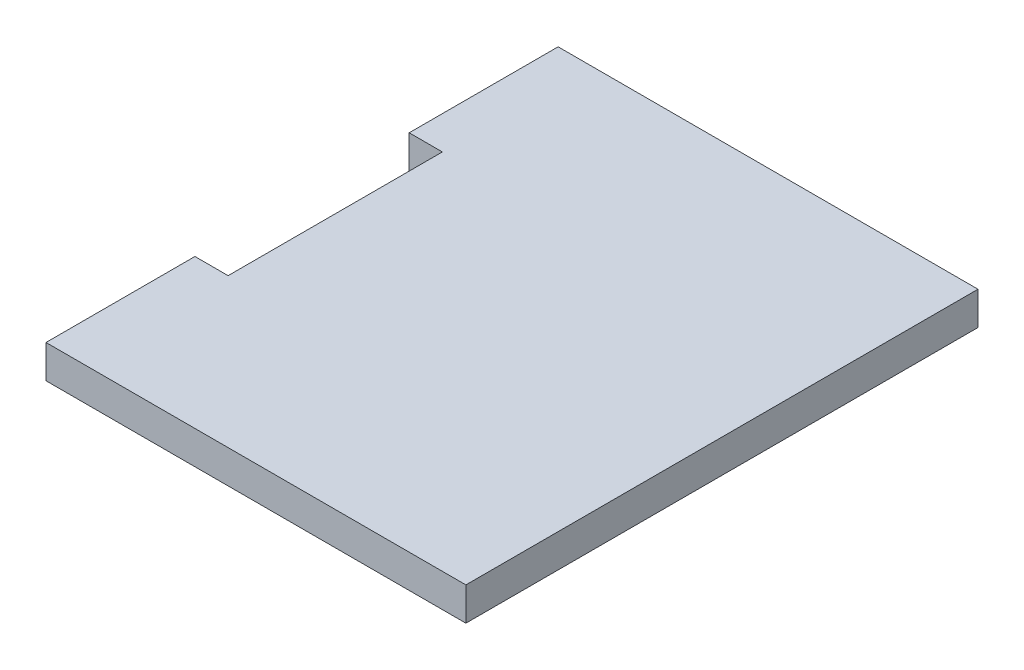
ISO-10303-21;
HEADER;
FILE_DESCRIPTION(('STEP AP214'),'2;1');
FILE_NAME('part.step','',(''),(''),'','','');
FILE_SCHEMA(('AUTOMOTIVE_DESIGN { 1 0 10303 214 1 1 1 1 }'));
ENDSEC;
DATA;
#1=APPLICATION_CONTEXT('core data for automotive mechanical design processes');
#2=APPLICATION_PROTOCOL_DEFINITION('international standard','automotive_design',2000,#1);
#3=PRODUCT_CONTEXT('',#1,'mechanical');
#4=PRODUCT('Part','Part','',(#3));
#5=PRODUCT_RELATED_PRODUCT_CATEGORY('part','',(#4));
#6=PRODUCT_DEFINITION_FORMATION('','',#4);
#7=PRODUCT_DEFINITION_CONTEXT('part definition',#1,'design');
#8=PRODUCT_DEFINITION('design','',#6,#7);
#9=PRODUCT_DEFINITION_SHAPE('','',#8);
#10=(LENGTH_UNIT() NAMED_UNIT(*) SI_UNIT(.MILLI.,.METRE.));
#11=(NAMED_UNIT(*) PLANE_ANGLE_UNIT() SI_UNIT($,.RADIAN.));
#12=(NAMED_UNIT(*) SI_UNIT($,.STERADIAN.) SOLID_ANGLE_UNIT());
#13=UNCERTAINTY_MEASURE_WITH_UNIT(LENGTH_MEASURE(1.E-05),#10,'distance_accuracy_value','');
#14=(GEOMETRIC_REPRESENTATION_CONTEXT(3) GLOBAL_UNCERTAINTY_ASSIGNED_CONTEXT((#13)) GLOBAL_UNIT_ASSIGNED_CONTEXT((#10,
#11,#12)) REPRESENTATION_CONTEXT('',''));
#15=CARTESIAN_POINT('',(0.,0.,0.));
#16=DIRECTION('',(0.,0.,1.));
#17=DIRECTION('',(1.,0.,0.));
#18=AXIS2_PLACEMENT_3D('',#15,#16,#17);
#19=CARTESIAN_POINT('',(-37.,3.175,0.));
#20=DIRECTION('',(-1.,0.,0.));
#21=DIRECTION('',(0.,0.,1.));
#22=AXIS2_PLACEMENT_3D('',#19,#20,#21);
#23=PLANE('',#22);
#24=DIRECTION('',(0.,0.,-1.));
#25=VECTOR('',#24,1.);
#26=CARTESIAN_POINT('',(-37.,0.,0.));
#27=LINE('',#26,#25);
#28=CARTESIAN_POINT('',(-37.,0.,-14.25));
#29=VERTEX_POINT('',#28);
#30=CARTESIAN_POINT('',(-37.,0.,-34.75));
#31=VERTEX_POINT('',#30);
#32=EDGE_CURVE('E162',#29,#31,#27,.T.);
#33=ORIENTED_EDGE('',*,*,#32,.F.);
#34=DIRECTION('',(0.,-1.,0.));
#35=VECTOR('',#34,1.);
#36=CARTESIAN_POINT('',(-37.,3.175,-14.25));
#37=LINE('',#36,#35);
#38=CARTESIAN_POINT('',(-37.,3.175,-14.25));
#39=VERTEX_POINT('',#38);
#40=EDGE_CURVE('E11',#39,#29,#37,.T.);
#41=ORIENTED_EDGE('',*,*,#40,.F.);
#42=DIRECTION('',(0.,0.,-1.));
#43=VECTOR('',#42,1.);
#44=CARTESIAN_POINT('',(-37.,3.175,0.));
#45=LINE('',#44,#43);
#46=CARTESIAN_POINT('',(-37.,3.175,-34.75));
#47=VERTEX_POINT('',#46);
#48=EDGE_CURVE('E134',#39,#47,#45,.T.);
#49=ORIENTED_EDGE('',*,*,#48,.T.);
#50=DIRECTION('',(0.,-1.,0.));
#51=VECTOR('',#50,1.);
#52=CARTESIAN_POINT('',(-37.,3.175,-34.75));
#53=LINE('',#52,#51);
#54=EDGE_CURVE('E82',#47,#31,#53,.T.);
#55=ORIENTED_EDGE('',*,*,#54,.T.);
#56=EDGE_LOOP('',(#33,#41,#49,#55));
#57=FACE_BOUND('',#56,.T.);
#58=ADVANCED_FACE('F32',(#57),#23,.T.);
#59=CARTESIAN_POINT('',(0.,3.175,-14.25));
#60=DIRECTION('',(0.,0.,-1.));
#61=DIRECTION('',(-1.,0.,0.));
#62=AXIS2_PLACEMENT_3D('',#59,#60,#61);
#63=PLANE('',#62);
#64=DIRECTION('',(1.,0.,0.));
#65=VECTOR('',#64,1.);
#66=CARTESIAN_POINT('',(0.,0.,-14.25));
#67=LINE('',#66,#65);
#68=CARTESIAN_POINT('',(-40.175,0.,-14.25));
#69=VERTEX_POINT('',#68);
#70=EDGE_CURVE('E159',#69,#29,#67,.T.);
#71=ORIENTED_EDGE('',*,*,#70,.F.);
#72=DIRECTION('',(0.,-1.,0.));
#73=VECTOR('',#72,1.);
#74=CARTESIAN_POINT('',(-40.175,3.175,-14.25));
#75=LINE('',#74,#73);
#76=CARTESIAN_POINT('',(-40.175,3.175,-14.25));
#77=VERTEX_POINT('',#76);
#78=EDGE_CURVE('E40',#77,#69,#75,.T.);
#79=ORIENTED_EDGE('',*,*,#78,.F.);
#80=DIRECTION('',(1.,0.,0.));
#81=VECTOR('',#80,1.);
#82=CARTESIAN_POINT('',(0.,3.175,-14.25));
#83=LINE('',#82,#81);
#84=EDGE_CURVE('E129',#77,#39,#83,.T.);
#85=ORIENTED_EDGE('',*,*,#84,.T.);
#86=ORIENTED_EDGE('',*,*,#40,.T.);
#87=EDGE_LOOP('',(#71,#79,#85,#86));
#88=FACE_BOUND('',#87,.T.);
#89=ADVANCED_FACE('F160',(#88),#63,.T.);
#90=CARTESIAN_POINT('',(-40.175,3.175,0.));
#91=DIRECTION('',(-1.,0.,0.));
#92=DIRECTION('',(0.,0.,1.));
#93=AXIS2_PLACEMENT_3D('',#90,#91,#92);
#94=PLANE('',#93);
#95=DIRECTION('',(0.,0.,-1.));
#96=VECTOR('',#95,1.);
#97=CARTESIAN_POINT('',(-40.175,0.,0.));
#98=LINE('',#97,#96);
#99=CARTESIAN_POINT('',(-40.175,0.,0.));
#100=VERTEX_POINT('',#99);
#101=EDGE_CURVE('E143',#100,#69,#98,.T.);
#102=ORIENTED_EDGE('',*,*,#101,.F.);
#103=DIRECTION('',(0.,-1.,0.));
#104=VECTOR('',#103,1.);
#105=CARTESIAN_POINT('',(-40.175,3.175,0.));
#106=LINE('',#105,#104);
#107=CARTESIAN_POINT('',(-40.175,3.175,0.));
#108=VERTEX_POINT('',#107);
#109=EDGE_CURVE('E152',#108,#100,#106,.T.);
#110=ORIENTED_EDGE('',*,*,#109,.F.);
#111=DIRECTION('',(0.,0.,-1.));
#112=VECTOR('',#111,1.);
#113=CARTESIAN_POINT('',(-40.175,3.175,0.));
#114=LINE('',#113,#112);
#115=EDGE_CURVE('E123',#108,#77,#114,.T.);
#116=ORIENTED_EDGE('',*,*,#115,.T.);
#117=ORIENTED_EDGE('',*,*,#78,.T.);
#118=EDGE_LOOP('',(#102,#110,#116,#117));
#119=FACE_BOUND('',#118,.T.);
#120=ADVANCED_FACE('F155',(#119),#94,.T.);
#121=CARTESIAN_POINT('',(0.,3.175,0.));
#122=DIRECTION('',(0.,0.,1.));
#123=DIRECTION('',(1.,0.,0.));
#124=AXIS2_PLACEMENT_3D('',#121,#122,#123);
#125=PLANE('',#124);
#126=DIRECTION('',(-1.,0.,0.));
#127=VECTOR('',#126,1.);
#128=CARTESIAN_POINT('',(0.,0.,0.));
#129=LINE('',#128,#127);
#130=CARTESIAN_POINT('',(0.,0.,0.));
#131=VERTEX_POINT('',#130);
#132=EDGE_CURVE('E167',#131,#100,#129,.T.);
#133=ORIENTED_EDGE('',*,*,#132,.F.);
#134=DIRECTION('',(0.,-1.,0.));
#135=VECTOR('',#134,1.);
#136=CARTESIAN_POINT('',(0.,3.175,0.));
#137=LINE('',#136,#135);
#138=CARTESIAN_POINT('',(0.,3.175,0.));
#139=VERTEX_POINT('',#138);
#140=EDGE_CURVE('E150',#139,#131,#137,.T.);
#141=ORIENTED_EDGE('',*,*,#140,.F.);
#142=DIRECTION('',(-1.,0.,0.));
#143=VECTOR('',#142,1.);
#144=CARTESIAN_POINT('',(0.,3.175,0.));
#145=LINE('',#144,#143);
#146=EDGE_CURVE('E128',#139,#108,#145,.T.);
#147=ORIENTED_EDGE('',*,*,#146,.T.);
#148=ORIENTED_EDGE('',*,*,#109,.T.);
#149=EDGE_LOOP('',(#133,#141,#147,#148));
#150=FACE_BOUND('',#149,.T.);
#151=ADVANCED_FACE('F181',(#150),#125,.T.);
#152=CARTESIAN_POINT('',(0.,3.175,0.));
#153=DIRECTION('',(-1.,0.,0.));
#154=DIRECTION('',(0.,0.,1.));
#155=AXIS2_PLACEMENT_3D('',#152,#153,#154);
#156=PLANE('',#155);
#157=DIRECTION('',(0.,0.,-1.));
#158=VECTOR('',#157,1.);
#159=CARTESIAN_POINT('',(0.,0.,0.));
#160=LINE('',#159,#158);
#161=CARTESIAN_POINT('',(0.,0.,-48.9999999999999));
#162=VERTEX_POINT('',#161);
#163=EDGE_CURVE('E168',#131,#162,#160,.T.);
#164=ORIENTED_EDGE('',*,*,#163,.T.);
#165=DIRECTION('',(0.,-1.,0.));
#166=VECTOR('',#165,1.);
#167=CARTESIAN_POINT('',(0.,3.175,-48.9999999999999));
#168=LINE('',#167,#166);
#169=CARTESIAN_POINT('',(0.,3.175,-48.9999999999999));
#170=VERTEX_POINT('',#169);
#171=EDGE_CURVE('E119',#170,#162,#168,.T.);
#172=ORIENTED_EDGE('',*,*,#171,.F.);
#173=DIRECTION('',(0.,0.,-1.));
#174=VECTOR('',#173,1.);
#175=CARTESIAN_POINT('',(0.,3.175,0.));
#176=LINE('',#175,#174);
#177=EDGE_CURVE('E106',#139,#170,#176,.T.);
#178=ORIENTED_EDGE('',*,*,#177,.F.);
#179=ORIENTED_EDGE('',*,*,#140,.T.);
#180=EDGE_LOOP('',(#164,#172,#178,#179));
#181=FACE_BOUND('',#180,.T.);
#182=ADVANCED_FACE('F172',(#181),#156,.F.);
#183=CARTESIAN_POINT('',(0.,3.175,-48.9999999999999));
#184=DIRECTION('',(0.,0.,1.));
#185=DIRECTION('',(1.,0.,0.));
#186=AXIS2_PLACEMENT_3D('',#183,#184,#185);
#187=PLANE('',#186);
#188=DIRECTION('',(-1.,0.,0.));
#189=VECTOR('',#188,1.);
#190=CARTESIAN_POINT('',(0.,0.,-48.9999999999999));
#191=LINE('',#190,#189);
#192=CARTESIAN_POINT('',(-40.175,0.,-48.9999999999999));
#193=VERTEX_POINT('',#192);
#194=EDGE_CURVE('E115',#162,#193,#191,.T.);
#195=ORIENTED_EDGE('',*,*,#194,.T.);
#196=DIRECTION('',(0.,-1.,0.));
#197=VECTOR('',#196,1.);
#198=CARTESIAN_POINT('',(-40.175,3.175,-48.9999999999999));
#199=LINE('',#198,#197);
#200=CARTESIAN_POINT('',(-40.175,3.175,-48.9999999999999));
#201=VERTEX_POINT('',#200);
#202=EDGE_CURVE('E112',#201,#193,#199,.T.);
#203=ORIENTED_EDGE('',*,*,#202,.F.);
#204=DIRECTION('',(-1.,0.,0.));
#205=VECTOR('',#204,1.);
#206=CARTESIAN_POINT('',(0.,3.175,-48.9999999999999));
#207=LINE('',#206,#205);
#208=EDGE_CURVE('E99',#170,#201,#207,.T.);
#209=ORIENTED_EDGE('',*,*,#208,.F.);
#210=ORIENTED_EDGE('',*,*,#171,.T.);
#211=EDGE_LOOP('',(#195,#203,#209,#210));
#212=FACE_BOUND('',#211,.T.);
#213=ADVANCED_FACE('F113',(#212),#187,.F.);
#214=CARTESIAN_POINT('',(-40.175,0.,-34.75));
#215=VERTEX_POINT('',#214);
#216=EDGE_CURVE('E139',#215,#193,#98,.T.);
#217=ORIENTED_EDGE('',*,*,#216,.F.);
#218=DIRECTION('',(0.,-1.,0.));
#219=VECTOR('',#218,1.);
#220=CARTESIAN_POINT('',(-40.175,3.175,-34.75));
#221=LINE('',#220,#219);
#222=CARTESIAN_POINT('',(-40.175,3.175,-34.75));
#223=VERTEX_POINT('',#222);
#224=EDGE_CURVE('E75',#223,#215,#221,.T.);
#225=ORIENTED_EDGE('',*,*,#224,.F.);
#226=EDGE_CURVE('E103',#223,#201,#114,.T.);
#227=ORIENTED_EDGE('',*,*,#226,.T.);
#228=ORIENTED_EDGE('',*,*,#202,.T.);
#229=EDGE_LOOP('',(#217,#225,#227,#228));
#230=FACE_BOUND('',#229,.T.);
#231=ADVANCED_FACE('F121',(#230),#94,.T.);
#232=CARTESIAN_POINT('',(0.,3.175,-34.75));
#233=DIRECTION('',(0.,0.,-1.));
#234=DIRECTION('',(-1.,0.,0.));
#235=AXIS2_PLACEMENT_3D('',#232,#233,#234);
#236=PLANE('',#235);
#237=DIRECTION('',(1.,0.,0.));
#238=VECTOR('',#237,1.);
#239=CARTESIAN_POINT('',(0.,0.,-34.75));
#240=LINE('',#239,#238);
#241=EDGE_CURVE('E137',#215,#31,#240,.T.);
#242=ORIENTED_EDGE('',*,*,#241,.T.);
#243=ORIENTED_EDGE('',*,*,#54,.F.);
#244=DIRECTION('',(1.,0.,0.));
#245=VECTOR('',#244,1.);
#246=CARTESIAN_POINT('',(0.,3.175,-34.75));
#247=LINE('',#246,#245);
#248=EDGE_CURVE('E48',#223,#47,#247,.T.);
#249=ORIENTED_EDGE('',*,*,#248,.F.);
#250=ORIENTED_EDGE('',*,*,#224,.T.);
#251=EDGE_LOOP('',(#242,#243,#249,#250));
#252=FACE_BOUND('',#251,.T.);
#253=ADVANCED_FACE('F192',(#252),#236,.F.);
#254=CARTESIAN_POINT('',(0.,3.175,0.));
#255=DIRECTION('',(0.,1.,0.));
#256=DIRECTION('',(0.,0.,1.));
#257=AXIS2_PLACEMENT_3D('',#254,#255,#256);
#258=PLANE('',#257);
#259=ORIENTED_EDGE('',*,*,#48,.F.);
#260=ORIENTED_EDGE('',*,*,#84,.F.);
#261=ORIENTED_EDGE('',*,*,#115,.F.);
#262=ORIENTED_EDGE('',*,*,#146,.F.);
#263=ORIENTED_EDGE('',*,*,#177,.T.);
#264=ORIENTED_EDGE('',*,*,#208,.T.);
#265=ORIENTED_EDGE('',*,*,#226,.F.);
#266=ORIENTED_EDGE('',*,*,#248,.T.);
#267=EDGE_LOOP('',(#259,#260,#261,#262,#263,#264,#265,#266));
#268=FACE_BOUND('',#267,.T.);
#269=ADVANCED_FACE('F101',(#268),#258,.T.);
#270=CARTESIAN_POINT('',(0.,0.,0.));
#271=DIRECTION('',(0.,1.,0.));
#272=DIRECTION('',(0.,0.,1.));
#273=AXIS2_PLACEMENT_3D('',#270,#271,#272);
#274=PLANE('',#273);
#275=ORIENTED_EDGE('',*,*,#32,.T.);
#276=ORIENTED_EDGE('',*,*,#241,.F.);
#277=ORIENTED_EDGE('',*,*,#216,.T.);
#278=ORIENTED_EDGE('',*,*,#194,.F.);
#279=ORIENTED_EDGE('',*,*,#163,.F.);
#280=ORIENTED_EDGE('',*,*,#132,.T.);
#281=ORIENTED_EDGE('',*,*,#101,.T.);
#282=ORIENTED_EDGE('',*,*,#70,.T.);
#283=EDGE_LOOP('',(#275,#276,#277,#278,#279,#280,#281,#282));
#284=FACE_BOUND('',#283,.T.);
#285=ADVANCED_FACE('F164',(#284),#274,.F.);
#286=CLOSED_SHELL('',(#58,#89,#120,#151,#182,#213,#231,#253,#269,#285));
#287=MANIFOLD_SOLID_BREP('B2',#286);
#288=ADVANCED_BREP_SHAPE_REPRESENTATION('',(#18,#287),#14);
#289=SHAPE_DEFINITION_REPRESENTATION(#9,#288);
ENDSEC;
END-ISO-10303-21;
